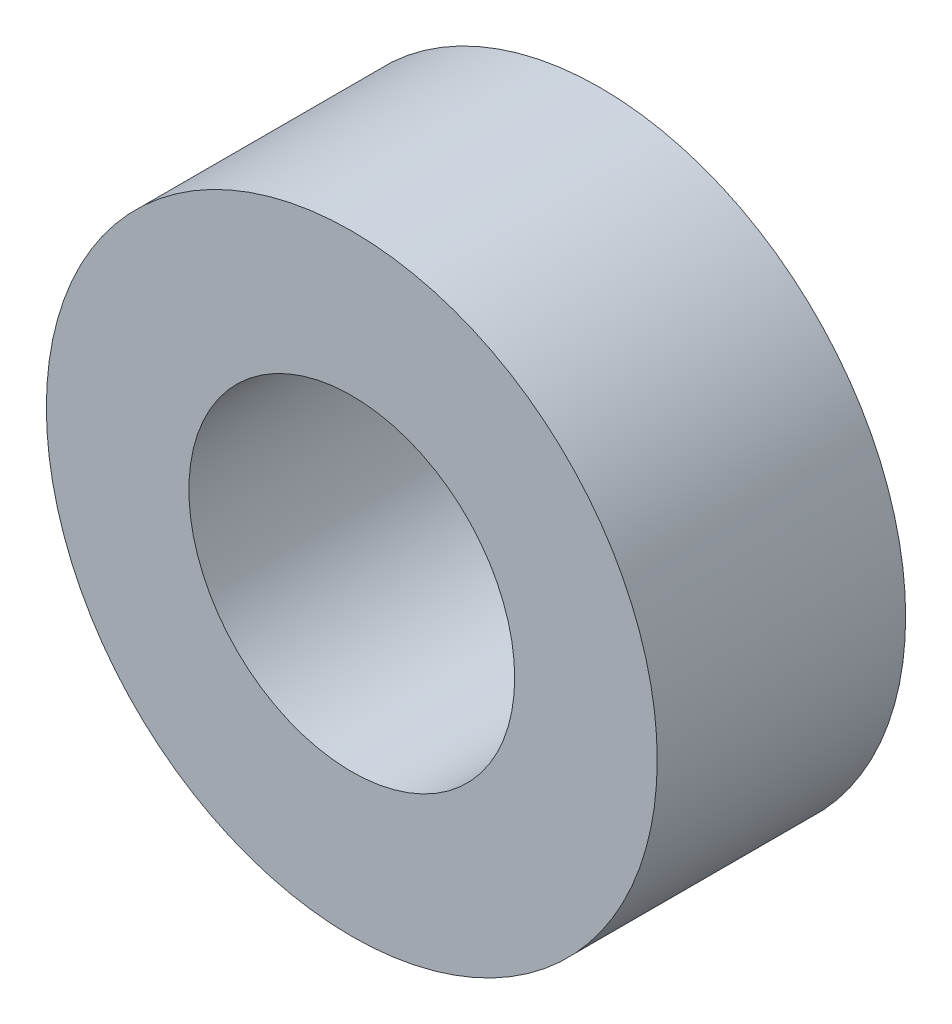
ISO-10303-21;
HEADER;
FILE_DESCRIPTION(('STEP AP214'),'2;1');
FILE_NAME('part.step','',(''),(''),'','','');
FILE_SCHEMA(('AUTOMOTIVE_DESIGN { 1 0 10303 214 1 1 1 1 }'));
ENDSEC;
DATA;
#1=APPLICATION_CONTEXT('core data for automotive mechanical design processes');
#2=APPLICATION_PROTOCOL_DEFINITION('international standard','automotive_design',2000,#1);
#3=PRODUCT_CONTEXT('',#1,'mechanical');
#4=PRODUCT('Part','Part','',(#3));
#5=PRODUCT_RELATED_PRODUCT_CATEGORY('part','',(#4));
#6=PRODUCT_DEFINITION_FORMATION('','',#4);
#7=PRODUCT_DEFINITION_CONTEXT('part definition',#1,'design');
#8=PRODUCT_DEFINITION('design','',#6,#7);
#9=PRODUCT_DEFINITION_SHAPE('','',#8);
#10=(LENGTH_UNIT() NAMED_UNIT(*) SI_UNIT(.MILLI.,.METRE.));
#11=(NAMED_UNIT(*) PLANE_ANGLE_UNIT() SI_UNIT($,.RADIAN.));
#12=(NAMED_UNIT(*) SI_UNIT($,.STERADIAN.) SOLID_ANGLE_UNIT());
#13=UNCERTAINTY_MEASURE_WITH_UNIT(LENGTH_MEASURE(1.E-05),#10,'distance_accuracy_value','');
#14=(GEOMETRIC_REPRESENTATION_CONTEXT(3) GLOBAL_UNCERTAINTY_ASSIGNED_CONTEXT((#13)) GLOBAL_UNIT_ASSIGNED_CONTEXT((#10,
#11,#12)) REPRESENTATION_CONTEXT('',''));
#15=CARTESIAN_POINT('',(0.,0.,0.));
#16=DIRECTION('',(0.,0.,1.));
#17=DIRECTION('',(1.,0.,0.));
#18=AXIS2_PLACEMENT_3D('',#15,#16,#17);
#19=CARTESIAN_POINT('',(0.,0.,6.1));
#20=DIRECTION('',(0.,0.,1.));
#21=DIRECTION('',(1.,0.,0.));
#22=AXIS2_PLACEMENT_3D('',#19,#20,#21);
#23=PLANE('',#22);
#24=CARTESIAN_POINT('',(0.,0.,6.1));
#25=DIRECTION('',(0.,0.,1.));
#26=DIRECTION('',(1.,0.,0.));
#27=AXIS2_PLACEMENT_3D('',#24,#25,#26);
#28=CIRCLE('',#27,7.5);
#29=CARTESIAN_POINT('',(7.5,0.,6.1));
#30=VERTEX_POINT('',#29);
#31=EDGE_CURVE('E10',#30,#30,#28,.T.);
#32=ORIENTED_EDGE('',*,*,#31,.T.);
#33=EDGE_LOOP('',(#32));
#34=FACE_BOUND('',#33,.T.);
#35=CARTESIAN_POINT('',(0.,0.,6.1));
#36=DIRECTION('',(0.,0.,1.));
#37=DIRECTION('',(1.,0.,0.));
#38=AXIS2_PLACEMENT_3D('',#35,#36,#37);
#39=CIRCLE('',#38,4.);
#40=CARTESIAN_POINT('',(4.,0.,6.1));
#41=VERTEX_POINT('',#40);
#42=EDGE_CURVE('E41',#41,#41,#39,.T.);
#43=ORIENTED_EDGE('',*,*,#42,.F.);
#44=EDGE_LOOP('',(#43));
#45=FACE_BOUND('',#44,.T.);
#46=ADVANCED_FACE('F30',(#34,#45),#23,.T.);
#47=CARTESIAN_POINT('',(0.,0.,0.));
#48=DIRECTION('',(0.,0.,1.));
#49=DIRECTION('',(1.,0.,0.));
#50=AXIS2_PLACEMENT_3D('',#47,#48,#49);
#51=PLANE('',#50);
#52=CARTESIAN_POINT('',(0.,0.,0.));
#53=DIRECTION('',(0.,0.,1.));
#54=DIRECTION('',(1.,0.,0.));
#55=AXIS2_PLACEMENT_3D('',#52,#53,#54);
#56=CIRCLE('',#55,7.5);
#57=CARTESIAN_POINT('',(7.5,0.,0.));
#58=VERTEX_POINT('',#57);
#59=EDGE_CURVE('E34',#58,#58,#56,.T.);
#60=ORIENTED_EDGE('',*,*,#59,.F.);
#61=EDGE_LOOP('',(#60));
#62=FACE_BOUND('',#61,.T.);
#63=CARTESIAN_POINT('',(0.,0.,0.));
#64=DIRECTION('',(0.,0.,1.));
#65=DIRECTION('',(1.,0.,0.));
#66=AXIS2_PLACEMENT_3D('',#63,#64,#65);
#67=CIRCLE('',#66,4.);
#68=CARTESIAN_POINT('',(4.,0.,0.));
#69=VERTEX_POINT('',#68);
#70=EDGE_CURVE('E43',#69,#69,#67,.T.);
#71=ORIENTED_EDGE('',*,*,#70,.T.);
#72=EDGE_LOOP('',(#71));
#73=FACE_BOUND('',#72,.T.);
#74=ADVANCED_FACE('F53',(#62,#73),#51,.F.);
#75=CARTESIAN_POINT('',(0.,0.,6.1));
#76=DIRECTION('',(0.,0.,-1.));
#77=DIRECTION('',(-1.,0.,0.));
#78=AXIS2_PLACEMENT_3D('',#75,#76,#77);
#79=CYLINDRICAL_SURFACE('',#78,7.5);
#80=ORIENTED_EDGE('',*,*,#31,.F.);
#81=EDGE_LOOP('',(#80));
#82=FACE_BOUND('',#81,.T.);
#83=ORIENTED_EDGE('',*,*,#59,.T.);
#84=EDGE_LOOP('',(#83));
#85=FACE_BOUND('',#84,.T.);
#86=ADVANCED_FACE('F32',(#82,#85),#79,.T.);
#87=CARTESIAN_POINT('',(0.,0.,6.1));
#88=DIRECTION('',(0.,0.,-1.));
#89=DIRECTION('',(-1.,0.,0.));
#90=AXIS2_PLACEMENT_3D('',#87,#88,#89);
#91=CYLINDRICAL_SURFACE('',#90,4.);
#92=ORIENTED_EDGE('',*,*,#42,.T.);
#93=EDGE_LOOP('',(#92));
#94=FACE_BOUND('',#93,.T.);
#95=ORIENTED_EDGE('',*,*,#70,.F.);
#96=EDGE_LOOP('',(#95));
#97=FACE_BOUND('',#96,.T.);
#98=ADVANCED_FACE('F49',(#94,#97),#91,.F.);
#99=CLOSED_SHELL('',(#46,#74,#86,#98));
#100=MANIFOLD_SOLID_BREP('B2',#99);
#101=ADVANCED_BREP_SHAPE_REPRESENTATION('',(#18,#100),#14);
#102=SHAPE_DEFINITION_REPRESENTATION(#9,#101);
ENDSEC;
END-ISO-10303-21;
